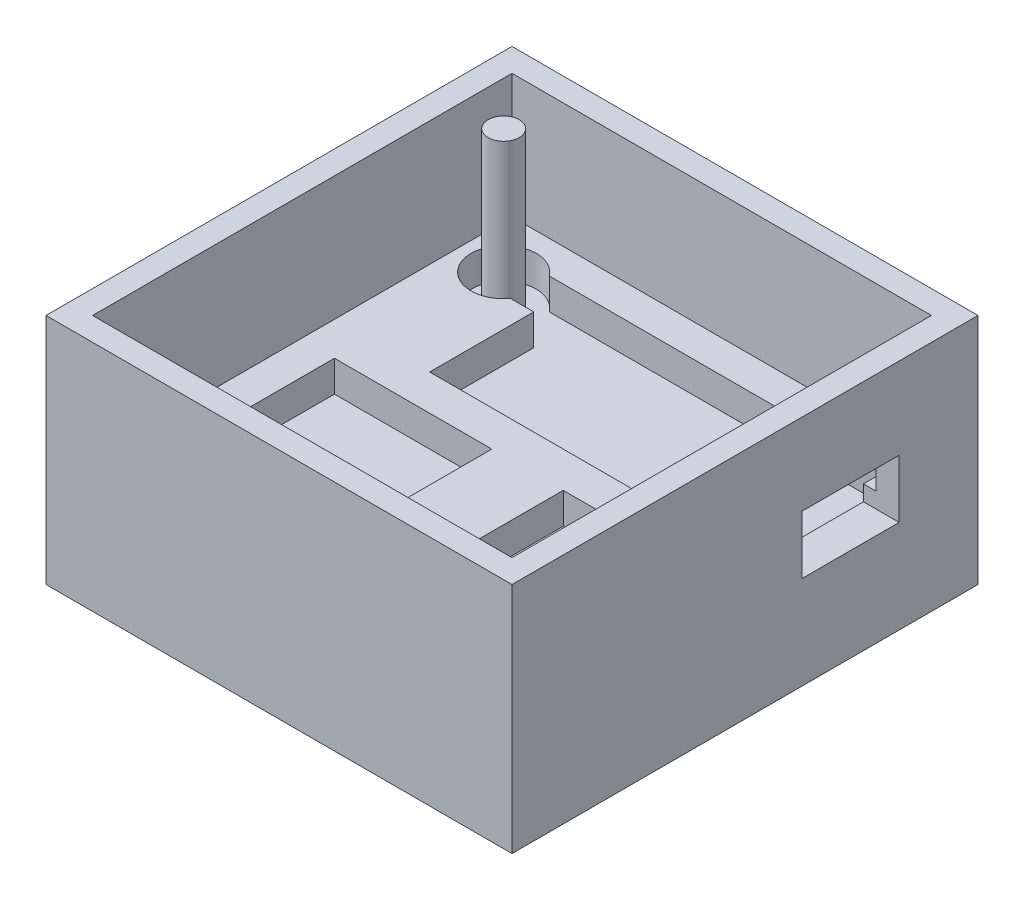
ISO-10303-21;
HEADER;
FILE_DESCRIPTION(('STEP AP214'),'2;1');
FILE_NAME('part.step','',(''),(''),'','','');
FILE_SCHEMA(('AUTOMOTIVE_DESIGN { 1 0 10303 214 1 1 1 1 }'));
ENDSEC;
DATA;
#1=APPLICATION_CONTEXT('core data for automotive mechanical design processes');
#2=APPLICATION_PROTOCOL_DEFINITION('international standard','automotive_design',2000,#1);
#3=PRODUCT_CONTEXT('',#1,'mechanical');
#4=PRODUCT('Part','Part','',(#3));
#5=PRODUCT_RELATED_PRODUCT_CATEGORY('part','',(#4));
#6=PRODUCT_DEFINITION_FORMATION('','',#4);
#7=PRODUCT_DEFINITION_CONTEXT('part definition',#1,'design');
#8=PRODUCT_DEFINITION('design','',#6,#7);
#9=PRODUCT_DEFINITION_SHAPE('','',#8);
#10=(LENGTH_UNIT() NAMED_UNIT(*) SI_UNIT(.MILLI.,.METRE.));
#11=(NAMED_UNIT(*) PLANE_ANGLE_UNIT() SI_UNIT($,.RADIAN.));
#12=(NAMED_UNIT(*) SI_UNIT($,.STERADIAN.) SOLID_ANGLE_UNIT());
#13=UNCERTAINTY_MEASURE_WITH_UNIT(LENGTH_MEASURE(1.E-05),#10,'distance_accuracy_value','');
#14=(GEOMETRIC_REPRESENTATION_CONTEXT(3) GLOBAL_UNCERTAINTY_ASSIGNED_CONTEXT((#13)) GLOBAL_UNIT_ASSIGNED_CONTEXT((#10,
#11,#12)) REPRESENTATION_CONTEXT('',''));
#15=CARTESIAN_POINT('',(0.,0.,0.));
#16=DIRECTION('',(0.,0.,1.));
#17=DIRECTION('',(1.,0.,0.));
#18=AXIS2_PLACEMENT_3D('',#15,#16,#17);
#19=CARTESIAN_POINT('',(38.1,38.1,38.1));
#20=DIRECTION('',(-1.,0.,0.));
#21=DIRECTION('',(0.,0.,1.));
#22=AXIS2_PLACEMENT_3D('',#19,#20,#21);
#23=PLANE('',#22);
#24=DIRECTION('',(0.,0.,-1.));
#25=VECTOR('',#24,1.);
#26=CARTESIAN_POINT('',(38.1,0.,38.1));
#27=LINE('',#26,#25);
#28=CARTESIAN_POINT('',(38.1,0.,38.1));
#29=VERTEX_POINT('',#28);
#30=CARTESIAN_POINT('',(38.1,0.,-38.1));
#31=VERTEX_POINT('',#30);
#32=EDGE_CURVE('E507',#29,#31,#27,.T.);
#33=ORIENTED_EDGE('',*,*,#32,.T.);
#34=DIRECTION('',(0.,-1.,0.));
#35=VECTOR('',#34,1.);
#36=CARTESIAN_POINT('',(38.1,38.1,-38.1));
#37=LINE('',#36,#35);
#38=CARTESIAN_POINT('',(38.1,38.1,-38.1));
#39=VERTEX_POINT('',#38);
#40=EDGE_CURVE('E521',#39,#31,#37,.T.);
#41=ORIENTED_EDGE('',*,*,#40,.F.);
#42=DIRECTION('',(0.,0.,-1.));
#43=VECTOR('',#42,1.);
#44=CARTESIAN_POINT('',(38.1,38.1,38.1));
#45=LINE('',#44,#43);
#46=CARTESIAN_POINT('',(38.1,38.1,38.1));
#47=VERTEX_POINT('',#46);
#48=EDGE_CURVE('E493',#47,#39,#45,.T.);
#49=ORIENTED_EDGE('',*,*,#48,.F.);
#50=DIRECTION('',(0.,-1.,0.));
#51=VECTOR('',#50,1.);
#52=CARTESIAN_POINT('',(38.1,38.1,38.1));
#53=LINE('',#52,#51);
#54=EDGE_CURVE('E517',#47,#29,#53,.T.);
#55=ORIENTED_EDGE('',*,*,#54,.T.);
#56=EDGE_LOOP('',(#33,#41,#49,#55));
#57=FACE_BOUND('',#56,.T.);
#58=DIRECTION('',(0.,1.,0.));
#59=VECTOR('',#58,1.);
#60=CARTESIAN_POINT('',(38.1,15.24,-9.3345));
#61=LINE('',#60,#59);
#62=CARTESIAN_POINT('',(38.1,15.24,-9.3345));
#63=VERTEX_POINT('',#62);
#64=CARTESIAN_POINT('',(38.1,24.765,-9.3345));
#65=VERTEX_POINT('',#64);
#66=EDGE_CURVE('E63',#63,#65,#61,.T.);
#67=ORIENTED_EDGE('',*,*,#66,.T.);
#68=DIRECTION('',(0.,0.,-1.));
#69=VECTOR('',#68,1.);
#70=CARTESIAN_POINT('',(38.1,24.765,-9.3345));
#71=LINE('',#70,#69);
#72=CARTESIAN_POINT('',(38.1,24.765,-25.2095));
#73=VERTEX_POINT('',#72);
#74=EDGE_CURVE('E272',#65,#73,#71,.T.);
#75=ORIENTED_EDGE('',*,*,#74,.T.);
#76=DIRECTION('',(0.,1.,0.));
#77=VECTOR('',#76,1.);
#78=CARTESIAN_POINT('',(38.1,15.24,-25.2095));
#79=LINE('',#78,#77);
#80=CARTESIAN_POINT('',(38.1,15.24,-25.2095));
#81=VERTEX_POINT('',#80);
#82=EDGE_CURVE('E276',#81,#73,#79,.T.);
#83=ORIENTED_EDGE('',*,*,#82,.F.);
#84=DIRECTION('',(0.,0.,-1.));
#85=VECTOR('',#84,1.);
#86=CARTESIAN_POINT('',(38.1,15.24,-9.3345));
#87=LINE('',#86,#85);
#88=EDGE_CURVE('E280',#63,#81,#87,.T.);
#89=ORIENTED_EDGE('',*,*,#88,.F.);
#90=EDGE_LOOP('',(#67,#75,#83,#89));
#91=FACE_BOUND('',#90,.T.);
#92=ADVANCED_FACE('F39',(#57,#91),#23,.F.);
#93=CARTESIAN_POINT('',(34.29,17.78,34.29));
#94=DIRECTION('',(1.,0.,0.));
#95=DIRECTION('',(0.,0.,-1.));
#96=AXIS2_PLACEMENT_3D('',#93,#94,#95);
#97=PLANE('',#96);
#98=DIRECTION('',(0.,1.,0.));
#99=VECTOR('',#98,1.);
#100=CARTESIAN_POINT('',(34.29,17.78,-9.3345));
#101=LINE('',#100,#99);
#102=CARTESIAN_POINT('',(34.29,17.78,-9.3345));
#103=VERTEX_POINT('',#102);
#104=CARTESIAN_POINT('',(34.29,24.765,-9.3345));
#105=VERTEX_POINT('',#104);
#106=EDGE_CURVE('E307',#103,#105,#101,.T.);
#107=ORIENTED_EDGE('',*,*,#106,.F.);
#108=DIRECTION('',(0.,0.,-1.));
#109=VECTOR('',#108,1.);
#110=CARTESIAN_POINT('',(34.29,17.78,34.29));
#111=LINE('',#110,#109);
#112=CARTESIAN_POINT('',(34.29,17.78,34.29));
#113=VERTEX_POINT('',#112);
#114=EDGE_CURVE('E363',#113,#103,#111,.T.);
#115=ORIENTED_EDGE('',*,*,#114,.F.);
#116=DIRECTION('',(0.,1.,0.));
#117=VECTOR('',#116,1.);
#118=CARTESIAN_POINT('',(34.29,17.78,34.29));
#119=LINE('',#118,#117);
#120=CARTESIAN_POINT('',(34.29,38.1,34.29));
#121=VERTEX_POINT('',#120);
#122=EDGE_CURVE('E375',#113,#121,#119,.T.);
#123=ORIENTED_EDGE('',*,*,#122,.T.);
#124=DIRECTION('',(0.,0.,-1.));
#125=VECTOR('',#124,1.);
#126=CARTESIAN_POINT('',(34.29,38.1,34.29));
#127=LINE('',#126,#125);
#128=CARTESIAN_POINT('',(34.29,38.1,-34.29));
#129=VERTEX_POINT('',#128);
#130=EDGE_CURVE('E378',#121,#129,#127,.T.);
#131=ORIENTED_EDGE('',*,*,#130,.T.);
#132=DIRECTION('',(0.,1.,0.));
#133=VECTOR('',#132,1.);
#134=CARTESIAN_POINT('',(34.29,17.78,-34.29));
#135=LINE('',#134,#133);
#136=CARTESIAN_POINT('',(34.29,17.78,-34.29));
#137=VERTEX_POINT('',#136);
#138=EDGE_CURVE('E396',#137,#129,#135,.T.);
#139=ORIENTED_EDGE('',*,*,#138,.F.);
#140=CARTESIAN_POINT('',(34.29,17.78,-25.2095));
#141=VERTEX_POINT('',#140);
#142=EDGE_CURVE('E361',#141,#137,#111,.T.);
#143=ORIENTED_EDGE('',*,*,#142,.F.);
#144=DIRECTION('',(0.,1.,0.));
#145=VECTOR('',#144,1.);
#146=CARTESIAN_POINT('',(34.29,17.78,-25.2095));
#147=LINE('',#146,#145);
#148=CARTESIAN_POINT('',(34.29,24.765,-25.2095));
#149=VERTEX_POINT('',#148);
#150=EDGE_CURVE('E299',#141,#149,#147,.T.);
#151=ORIENTED_EDGE('',*,*,#150,.T.);
#152=DIRECTION('',(0.,0.,-1.));
#153=VECTOR('',#152,1.);
#154=CARTESIAN_POINT('',(34.29,24.765,34.29));
#155=LINE('',#154,#153);
#156=EDGE_CURVE('E48',#105,#149,#155,.T.);
#157=ORIENTED_EDGE('',*,*,#156,.F.);
#158=EDGE_LOOP('',(#107,#115,#123,#131,#139,#143,#151,#157));
#159=FACE_BOUND('',#158,.T.);
#160=ADVANCED_FACE('F549',(#159),#97,.F.);
#161=CARTESIAN_POINT('',(0.,17.78,0.));
#162=DIRECTION('',(0.,1.,0.));
#163=DIRECTION('',(0.,0.,1.));
#164=AXIS2_PLACEMENT_3D('',#161,#162,#163);
#165=PLANE('',#164);
#166=DIRECTION('',(1.,0.,0.));
#167=VECTOR('',#166,1.);
#168=CARTESIAN_POINT('',(-19.05,17.78,-22.606));
#169=LINE('',#168,#167);
#170=CARTESIAN_POINT('',(-22.86,17.78,-22.606));
#171=VERTEX_POINT('',#170);
#172=CARTESIAN_POINT('',(-19.05,17.78,-22.606));
#173=VERTEX_POINT('',#172);
#174=EDGE_CURVE('E262',#171,#173,#169,.T.);
#175=ORIENTED_EDGE('',*,*,#174,.F.);
#176=CARTESIAN_POINT('',(-27.140733667368,17.78,-25.781));
#177=DIRECTION('',(0.,1.,0.));
#178=DIRECTION('',(0.,0.,1.));
#179=AXIS2_PLACEMENT_3D('',#176,#177,#178);
#180=CIRCLE('',#179,5.32966281587666);
#181=CARTESIAN_POINT('',(-22.86,17.78,-28.956));
#182=VERTEX_POINT('',#181);
#183=EDGE_CURVE('E258',#182,#171,#180,.T.);
#184=ORIENTED_EDGE('',*,*,#183,.F.);
#185=DIRECTION('',(-1.,0.,0.));
#186=VECTOR('',#185,1.);
#187=CARTESIAN_POINT('',(-19.05,17.78,-28.956));
#188=LINE('',#187,#186);
#189=CARTESIAN_POINT('',(32.258,17.78,-28.956));
#190=VERTEX_POINT('',#189);
#191=EDGE_CURVE('E243',#190,#182,#188,.T.);
#192=ORIENTED_EDGE('',*,*,#191,.F.);
#193=DIRECTION('',(0.,0.,-1.));
#194=VECTOR('',#193,1.);
#195=CARTESIAN_POINT('',(32.258,17.78,-28.956));
#196=LINE('',#195,#194);
#197=CARTESIAN_POINT('',(32.258,17.78,-25.2095));
#198=VERTEX_POINT('',#197);
#199=EDGE_CURVE('E317',#198,#190,#196,.T.);
#200=ORIENTED_EDGE('',*,*,#199,.F.);
#201=DIRECTION('',(-1.,0.,0.));
#202=VECTOR('',#201,1.);
#203=CARTESIAN_POINT('',(0.,17.78,-25.2095));
#204=LINE('',#203,#202);
#205=EDGE_CURVE('E296',#141,#198,#204,.T.);
#206=ORIENTED_EDGE('',*,*,#205,.F.);
#207=ORIENTED_EDGE('',*,*,#142,.T.);
#208=DIRECTION('',(-1.,0.,0.));
#209=VECTOR('',#208,1.);
#210=CARTESIAN_POINT('',(-34.29,17.78,-34.29));
#211=LINE('',#210,#209);
#212=CARTESIAN_POINT('',(-34.29,17.78,-34.29));
#213=VERTEX_POINT('',#212);
#214=EDGE_CURVE('E367',#137,#213,#211,.T.);
#215=ORIENTED_EDGE('',*,*,#214,.T.);
#216=DIRECTION('',(0.,0.,1.));
#217=VECTOR('',#216,1.);
#218=CARTESIAN_POINT('',(-34.29,17.78,34.29));
#219=LINE('',#218,#217);
#220=CARTESIAN_POINT('',(-34.29,17.78,34.29));
#221=VERTEX_POINT('',#220);
#222=EDGE_CURVE('E371',#213,#221,#219,.T.);
#223=ORIENTED_EDGE('',*,*,#222,.T.);
#224=DIRECTION('',(1.,0.,0.));
#225=VECTOR('',#224,1.);
#226=CARTESIAN_POINT('',(-34.29,17.78,34.29));
#227=LINE('',#226,#225);
#228=EDGE_CURVE('E357',#221,#113,#227,.T.);
#229=ORIENTED_EDGE('',*,*,#228,.T.);
#230=ORIENTED_EDGE('',*,*,#114,.T.);
#231=DIRECTION('',(-1.,0.,0.));
#232=VECTOR('',#231,1.);
#233=CARTESIAN_POINT('',(0.,17.78,-9.3345));
#234=LINE('',#233,#232);
#235=CARTESIAN_POINT('',(32.258,17.78,-9.3345));
#236=VERTEX_POINT('',#235);
#237=EDGE_CURVE('E303',#103,#236,#234,.T.);
#238=ORIENTED_EDGE('',*,*,#237,.T.);
#239=CARTESIAN_POINT('',(32.258,17.78,-5.58800000000001));
#240=VERTEX_POINT('',#239);
#241=EDGE_CURVE('E318',#240,#236,#196,.T.);
#242=ORIENTED_EDGE('',*,*,#241,.F.);
#243=DIRECTION('',(1.,0.,0.));
#244=VECTOR('',#243,1.);
#245=CARTESIAN_POINT('',(-19.05,17.78,-5.58800000000001));
#246=LINE('',#245,#244);
#247=CARTESIAN_POINT('',(-19.05,17.78,-5.58800000000001));
#248=VERTEX_POINT('',#247);
#249=EDGE_CURVE('E313',#248,#240,#246,.T.);
#250=ORIENTED_EDGE('',*,*,#249,.F.);
#251=DIRECTION('',(0.,0.,1.));
#252=VECTOR('',#251,1.);
#253=CARTESIAN_POINT('',(-19.05,17.78,-28.956));
#254=LINE('',#253,#252);
#255=EDGE_CURVE('E310',#173,#248,#254,.T.);
#256=ORIENTED_EDGE('',*,*,#255,.F.);
#257=EDGE_LOOP('',(#175,#184,#192,#200,#206,#207,#215,#223,#229,#230,#238,#242,#250,#256));
#258=FACE_BOUND('',#257,.T.);
#259=DIRECTION('',(-1.,0.,0.));
#260=VECTOR('',#259,1.);
#261=CARTESIAN_POINT('',(8.63600000000004,17.78,0.25399999999999));
#262=LINE('',#261,#260);
#263=CARTESIAN_POINT('',(32.258,17.78,0.25399999999999));
#264=VERTEX_POINT('',#263);
#265=CARTESIAN_POINT('',(8.63600000000004,17.78,0.25399999999999));
#266=VERTEX_POINT('',#265);
#267=EDGE_CURVE('E336',#264,#266,#262,.T.);
#268=ORIENTED_EDGE('',*,*,#267,.F.);
#269=DIRECTION('',(0.,0.,-1.));
#270=VECTOR('',#269,1.);
#271=CARTESIAN_POINT('',(32.258,17.78,0.25399999999999));
#272=LINE('',#271,#270);
#273=CARTESIAN_POINT('',(32.258,17.78,31.242));
#274=VERTEX_POINT('',#273);
#275=EDGE_CURVE('E332',#274,#264,#272,.T.);
#276=ORIENTED_EDGE('',*,*,#275,.F.);
#277=DIRECTION('',(1.,0.,0.));
#278=VECTOR('',#277,1.);
#279=CARTESIAN_POINT('',(8.63600000000004,17.78,31.242));
#280=LINE('',#279,#278);
#281=CARTESIAN_POINT('',(8.63600000000004,17.78,31.242));
#282=VERTEX_POINT('',#281);
#283=EDGE_CURVE('E328',#282,#274,#280,.T.);
#284=ORIENTED_EDGE('',*,*,#283,.F.);
#285=DIRECTION('',(0.,0.,1.));
#286=VECTOR('',#285,1.);
#287=CARTESIAN_POINT('',(8.63600000000004,17.78,0.25399999999999));
#288=LINE('',#287,#286);
#289=EDGE_CURVE('E324',#266,#282,#288,.T.);
#290=ORIENTED_EDGE('',*,*,#289,.F.);
#291=EDGE_LOOP('',(#268,#276,#284,#290));
#292=FACE_BOUND('',#291,.T.);
#293=DIRECTION('',(-1.,0.,0.));
#294=VECTOR('',#293,1.);
#295=CARTESIAN_POINT('',(-28.7782,17.78,0.25399999999999));
#296=LINE('',#295,#294);
#297=CARTESIAN_POINT('',(-3.04799999999996,17.78,0.25399999999999));
#298=VERTEX_POINT('',#297);
#299=CARTESIAN_POINT('',(-28.7782,17.78,0.25399999999999));
#300=VERTEX_POINT('',#299);
#301=EDGE_CURVE('E352',#298,#300,#296,.T.);
#302=ORIENTED_EDGE('',*,*,#301,.F.);
#303=DIRECTION('',(0.,0.,-1.));
#304=VECTOR('',#303,1.);
#305=CARTESIAN_POINT('',(-3.04799999999996,17.78,0.25399999999999));
#306=LINE('',#305,#304);
#307=CARTESIAN_POINT('',(-3.04799999999996,17.78,28.7782));
#308=VERTEX_POINT('',#307);
#309=EDGE_CURVE('E348',#308,#298,#306,.T.);
#310=ORIENTED_EDGE('',*,*,#309,.F.);
#311=DIRECTION('',(1.,0.,0.));
#312=VECTOR('',#311,1.);
#313=CARTESIAN_POINT('',(-28.7782,17.78,28.7782));
#314=LINE('',#313,#312);
#315=CARTESIAN_POINT('',(-28.7782,17.78,28.7782));
#316=VERTEX_POINT('',#315);
#317=EDGE_CURVE('E344',#316,#308,#314,.T.);
#318=ORIENTED_EDGE('',*,*,#317,.F.);
#319=DIRECTION('',(0.,0.,1.));
#320=VECTOR('',#319,1.);
#321=CARTESIAN_POINT('',(-28.7782,17.78,0.25399999999999));
#322=LINE('',#321,#320);
#323=EDGE_CURVE('E340',#300,#316,#322,.T.);
#324=ORIENTED_EDGE('',*,*,#323,.F.);
#325=EDGE_LOOP('',(#302,#310,#318,#324));
#326=FACE_BOUND('',#325,.T.);
#327=ADVANCED_FACE('F561',(#258,#292,#326),#165,.T.);
#328=CARTESIAN_POINT('',(32.258,12.7,-5.58800000000001));
#329=DIRECTION('',(1.,0.,0.));
#330=DIRECTION('',(0.,0.,-1.));
#331=AXIS2_PLACEMENT_3D('',#328,#329,#330);
#332=PLANE('',#331);
#333=DIRECTION('',(0.,1.,0.));
#334=VECTOR('',#333,1.);
#335=CARTESIAN_POINT('',(32.258,12.7,-9.3345));
#336=LINE('',#335,#334);
#337=CARTESIAN_POINT('',(32.258,15.24,-9.3345));
#338=VERTEX_POINT('',#337);
#339=EDGE_CURVE('E533',#338,#236,#336,.T.);
#340=ORIENTED_EDGE('',*,*,#339,.F.);
#341=DIRECTION('',(0.,0.,-1.));
#342=VECTOR('',#341,1.);
#343=CARTESIAN_POINT('',(32.258,15.24,-5.58800000000001));
#344=LINE('',#343,#342);
#345=CARTESIAN_POINT('',(32.258,15.24,-25.2095));
#346=VERTEX_POINT('',#345);
#347=EDGE_CURVE('E516',#338,#346,#344,.T.);
#348=ORIENTED_EDGE('',*,*,#347,.T.);
#349=DIRECTION('',(0.,1.,0.));
#350=VECTOR('',#349,1.);
#351=CARTESIAN_POINT('',(32.258,12.7,-25.2095));
#352=LINE('',#351,#350);
#353=EDGE_CURVE('E529',#346,#198,#352,.T.);
#354=ORIENTED_EDGE('',*,*,#353,.T.);
#355=ORIENTED_EDGE('',*,*,#199,.T.);
#356=DIRECTION('',(0.,1.,0.));
#357=VECTOR('',#356,1.);
#358=CARTESIAN_POINT('',(32.258,12.7,-28.956));
#359=LINE('',#358,#357);
#360=CARTESIAN_POINT('',(32.258,12.7,-28.956));
#361=VERTEX_POINT('',#360);
#362=EDGE_CURVE('E410',#361,#190,#359,.T.);
#363=ORIENTED_EDGE('',*,*,#362,.F.);
#364=DIRECTION('',(0.,0.,-1.));
#365=VECTOR('',#364,1.);
#366=CARTESIAN_POINT('',(32.258,12.7,-5.58800000000001));
#367=LINE('',#366,#365);
#368=CARTESIAN_POINT('',(32.258,12.7,-5.58800000000001));
#369=VERTEX_POINT('',#368);
#370=EDGE_CURVE('E233',#369,#361,#367,.T.);
#371=ORIENTED_EDGE('',*,*,#370,.F.);
#372=DIRECTION('',(0.,1.,0.));
#373=VECTOR('',#372,1.);
#374=CARTESIAN_POINT('',(32.258,12.7,-5.58800000000001));
#375=LINE('',#374,#373);
#376=EDGE_CURVE('E411',#369,#240,#375,.T.);
#377=ORIENTED_EDGE('',*,*,#376,.T.);
#378=ORIENTED_EDGE('',*,*,#241,.T.);
#379=EDGE_LOOP('',(#340,#348,#354,#355,#363,#371,#377,#378));
#380=FACE_BOUND('',#379,.T.);
#381=ADVANCED_FACE('F558',(#380),#332,.F.);
#382=CARTESIAN_POINT('',(-38.1,38.1,38.1));
#383=DIRECTION('',(-1.,0.,0.));
#384=DIRECTION('',(0.,0.,1.));
#385=AXIS2_PLACEMENT_3D('',#382,#383,#384);
#386=PLANE('',#385);
#387=DIRECTION('',(0.,0.,-1.));
#388=VECTOR('',#387,1.);
#389=CARTESIAN_POINT('',(-38.1,0.,38.1));
#390=LINE('',#389,#388);
#391=CARTESIAN_POINT('',(-38.1,0.,38.1));
#392=VERTEX_POINT('',#391);
#393=CARTESIAN_POINT('',(-38.1,0.,-38.1));
#394=VERTEX_POINT('',#393);
#395=EDGE_CURVE('E415',#392,#394,#390,.T.);
#396=ORIENTED_EDGE('',*,*,#395,.F.);
#397=DIRECTION('',(0.,-1.,0.));
#398=VECTOR('',#397,1.);
#399=CARTESIAN_POINT('',(-38.1,38.1,38.1));
#400=LINE('',#399,#398);
#401=CARTESIAN_POINT('',(-38.1,38.1,38.1));
#402=VERTEX_POINT('',#401);
#403=EDGE_CURVE('E513',#402,#392,#400,.T.);
#404=ORIENTED_EDGE('',*,*,#403,.F.);
#405=DIRECTION('',(0.,0.,-1.));
#406=VECTOR('',#405,1.);
#407=CARTESIAN_POINT('',(-38.1,38.1,38.1));
#408=LINE('',#407,#406);
#409=CARTESIAN_POINT('',(-38.1,38.1,-38.1));
#410=VERTEX_POINT('',#409);
#411=EDGE_CURVE('E484',#402,#410,#408,.T.);
#412=ORIENTED_EDGE('',*,*,#411,.T.);
#413=DIRECTION('',(0.,-1.,0.));
#414=VECTOR('',#413,1.);
#415=CARTESIAN_POINT('',(-38.1,38.1,-38.1));
#416=LINE('',#415,#414);
#417=EDGE_CURVE('E499',#410,#394,#416,.T.);
#418=ORIENTED_EDGE('',*,*,#417,.T.);
#419=EDGE_LOOP('',(#396,#404,#412,#418));
#420=FACE_BOUND('',#419,.T.);
#421=ADVANCED_FACE('F41',(#420),#386,.T.);
#422=CARTESIAN_POINT('',(-38.1,38.1,38.1));
#423=DIRECTION('',(0.,0.,-1.));
#424=DIRECTION('',(-1.,0.,0.));
#425=AXIS2_PLACEMENT_3D('',#422,#423,#424);
#426=PLANE('',#425);
#427=DIRECTION('',(1.,0.,0.));
#428=VECTOR('',#427,1.);
#429=CARTESIAN_POINT('',(-38.1,0.,38.1));
#430=LINE('',#429,#428);
#431=EDGE_CURVE('E489',#392,#29,#430,.T.);
#432=ORIENTED_EDGE('',*,*,#431,.T.);
#433=ORIENTED_EDGE('',*,*,#54,.F.);
#434=DIRECTION('',(1.,0.,0.));
#435=VECTOR('',#434,1.);
#436=CARTESIAN_POINT('',(-38.1,38.1,38.1));
#437=LINE('',#436,#435);
#438=EDGE_CURVE('E496',#402,#47,#437,.T.);
#439=ORIENTED_EDGE('',*,*,#438,.F.);
#440=ORIENTED_EDGE('',*,*,#403,.T.);
#441=EDGE_LOOP('',(#432,#433,#439,#440));
#442=FACE_BOUND('',#441,.T.);
#443=ADVANCED_FACE('F611',(#442),#426,.F.);
#444=CARTESIAN_POINT('',(-38.1,38.1,-38.1));
#445=DIRECTION('',(0.,0.,-1.));
#446=DIRECTION('',(-1.,0.,0.));
#447=AXIS2_PLACEMENT_3D('',#444,#445,#446);
#448=PLANE('',#447);
#449=DIRECTION('',(1.,0.,0.));
#450=VECTOR('',#449,1.);
#451=CARTESIAN_POINT('',(-38.1,0.,-38.1));
#452=LINE('',#451,#450);
#453=EDGE_CURVE('E503',#394,#31,#452,.T.);
#454=ORIENTED_EDGE('',*,*,#453,.F.);
#455=ORIENTED_EDGE('',*,*,#417,.F.);
#456=DIRECTION('',(1.,0.,0.));
#457=VECTOR('',#456,1.);
#458=CARTESIAN_POINT('',(-38.1,38.1,-38.1));
#459=LINE('',#458,#457);
#460=EDGE_CURVE('E488',#410,#39,#459,.T.);
#461=ORIENTED_EDGE('',*,*,#460,.T.);
#462=ORIENTED_EDGE('',*,*,#40,.T.);
#463=EDGE_LOOP('',(#454,#455,#461,#462));
#464=FACE_BOUND('',#463,.T.);
#465=ADVANCED_FACE('F613',(#464),#448,.T.);
#466=CARTESIAN_POINT('',(0.,38.1,0.));
#467=DIRECTION('',(0.,-1.,0.));
#468=DIRECTION('',(0.,0.,-1.));
#469=AXIS2_PLACEMENT_3D('',#466,#467,#468);
#470=PLANE('',#469);
#471=ORIENTED_EDGE('',*,*,#130,.F.);
#472=DIRECTION('',(1.,0.,0.));
#473=VECTOR('',#472,1.);
#474=CARTESIAN_POINT('',(-34.29,38.1,34.29));
#475=LINE('',#474,#473);
#476=CARTESIAN_POINT('',(-34.29,38.1,34.29));
#477=VERTEX_POINT('',#476);
#478=EDGE_CURVE('E356',#477,#121,#475,.T.);
#479=ORIENTED_EDGE('',*,*,#478,.F.);
#480=DIRECTION('',(0.,0.,1.));
#481=VECTOR('',#480,1.);
#482=CARTESIAN_POINT('',(-34.29,38.1,34.29));
#483=LINE('',#482,#481);
#484=CARTESIAN_POINT('',(-34.29,38.1,-34.29));
#485=VERTEX_POINT('',#484);
#486=EDGE_CURVE('E362',#485,#477,#483,.T.);
#487=ORIENTED_EDGE('',*,*,#486,.F.);
#488=DIRECTION('',(-1.,0.,0.));
#489=VECTOR('',#488,1.);
#490=CARTESIAN_POINT('',(-34.29,38.1,-34.29));
#491=LINE('',#490,#489);
#492=EDGE_CURVE('E382',#129,#485,#491,.T.);
#493=ORIENTED_EDGE('',*,*,#492,.F.);
#494=EDGE_LOOP('',(#471,#479,#487,#493));
#495=FACE_BOUND('',#494,.T.);
#496=ORIENTED_EDGE('',*,*,#411,.F.);
#497=ORIENTED_EDGE('',*,*,#438,.T.);
#498=ORIENTED_EDGE('',*,*,#48,.T.);
#499=ORIENTED_EDGE('',*,*,#460,.F.);
#500=EDGE_LOOP('',(#496,#497,#498,#499));
#501=FACE_BOUND('',#500,.T.);
#502=ADVANCED_FACE('F584',(#495,#501),#470,.F.);
#503=CARTESIAN_POINT('',(0.,0.,0.));
#504=DIRECTION('',(0.,-1.,0.));
#505=DIRECTION('',(0.,0.,-1.));
#506=AXIS2_PLACEMENT_3D('',#503,#504,#505);
#507=PLANE('',#506);
#508=ORIENTED_EDGE('',*,*,#395,.T.);
#509=ORIENTED_EDGE('',*,*,#453,.T.);
#510=ORIENTED_EDGE('',*,*,#32,.F.);
#511=ORIENTED_EDGE('',*,*,#431,.F.);
#512=EDGE_LOOP('',(#508,#509,#510,#511));
#513=FACE_BOUND('',#512,.T.);
#514=ADVANCED_FACE('F599',(#513),#507,.T.);
#515=CARTESIAN_POINT('',(-34.29,17.78,34.29));
#516=DIRECTION('',(0.,0.,1.));
#517=DIRECTION('',(1.,0.,0.));
#518=AXIS2_PLACEMENT_3D('',#515,#516,#517);
#519=PLANE('',#518);
#520=ORIENTED_EDGE('',*,*,#478,.T.);
#521=ORIENTED_EDGE('',*,*,#122,.F.);
#522=ORIENTED_EDGE('',*,*,#228,.F.);
#523=DIRECTION('',(0.,1.,0.));
#524=VECTOR('',#523,1.);
#525=CARTESIAN_POINT('',(-34.29,17.78,34.29));
#526=LINE('',#525,#524);
#527=EDGE_CURVE('E389',#221,#477,#526,.T.);
#528=ORIENTED_EDGE('',*,*,#527,.T.);
#529=EDGE_LOOP('',(#520,#521,#522,#528));
#530=FACE_BOUND('',#529,.T.);
#531=ADVANCED_FACE('F580',(#530),#519,.F.);
#532=CARTESIAN_POINT('',(-34.29,17.78,34.29));
#533=DIRECTION('',(-1.,0.,0.));
#534=DIRECTION('',(0.,0.,1.));
#535=AXIS2_PLACEMENT_3D('',#532,#533,#534);
#536=PLANE('',#535);
#537=ORIENTED_EDGE('',*,*,#486,.T.);
#538=ORIENTED_EDGE('',*,*,#527,.F.);
#539=ORIENTED_EDGE('',*,*,#222,.F.);
#540=DIRECTION('',(0.,1.,0.));
#541=VECTOR('',#540,1.);
#542=CARTESIAN_POINT('',(-34.29,17.78,-34.29));
#543=LINE('',#542,#541);
#544=EDGE_CURVE('E393',#213,#485,#543,.T.);
#545=ORIENTED_EDGE('',*,*,#544,.T.);
#546=EDGE_LOOP('',(#537,#538,#539,#545));
#547=FACE_BOUND('',#546,.T.);
#548=ADVANCED_FACE('F590',(#547),#536,.F.);
#549=CARTESIAN_POINT('',(-34.29,17.78,-34.29));
#550=DIRECTION('',(0.,0.,-1.));
#551=DIRECTION('',(-1.,0.,0.));
#552=AXIS2_PLACEMENT_3D('',#549,#550,#551);
#553=PLANE('',#552);
#554=ORIENTED_EDGE('',*,*,#492,.T.);
#555=ORIENTED_EDGE('',*,*,#544,.F.);
#556=ORIENTED_EDGE('',*,*,#214,.F.);
#557=ORIENTED_EDGE('',*,*,#138,.T.);
#558=EDGE_LOOP('',(#554,#555,#556,#557));
#559=FACE_BOUND('',#558,.T.);
#560=ADVANCED_FACE('F588',(#559),#553,.F.);
#561=CARTESIAN_POINT('',(0.,12.7,0.));
#562=DIRECTION('',(0.,1.,0.));
#563=DIRECTION('',(0.,0.,1.));
#564=AXIS2_PLACEMENT_3D('',#561,#562,#563);
#565=PLANE('',#564);
#566=DIRECTION('',(0.,0.,-1.));
#567=VECTOR('',#566,1.);
#568=CARTESIAN_POINT('',(32.258,12.7,0.25399999999999));
#569=LINE('',#568,#567);
#570=CARTESIAN_POINT('',(32.258,12.7,31.242));
#571=VERTEX_POINT('',#570);
#572=CARTESIAN_POINT('',(32.258,12.7,0.25399999999999));
#573=VERTEX_POINT('',#572);
#574=EDGE_CURVE('E422',#571,#573,#569,.T.);
#575=ORIENTED_EDGE('',*,*,#574,.T.);
#576=DIRECTION('',(-1.,0.,0.));
#577=VECTOR('',#576,1.);
#578=CARTESIAN_POINT('',(8.63600000000004,12.7,0.25399999999999));
#579=LINE('',#578,#577);
#580=CARTESIAN_POINT('',(8.63600000000004,12.7,0.25399999999999));
#581=VERTEX_POINT('',#580);
#582=EDGE_CURVE('E426',#573,#581,#579,.T.);
#583=ORIENTED_EDGE('',*,*,#582,.T.);
#584=DIRECTION('',(0.,0.,1.));
#585=VECTOR('',#584,1.);
#586=CARTESIAN_POINT('',(8.63600000000004,12.7,0.25399999999999));
#587=LINE('',#586,#585);
#588=CARTESIAN_POINT('',(8.63600000000004,12.7,31.242));
#589=VERTEX_POINT('',#588);
#590=EDGE_CURVE('E431',#581,#589,#587,.T.);
#591=ORIENTED_EDGE('',*,*,#590,.T.);
#592=DIRECTION('',(1.,0.,0.));
#593=VECTOR('',#592,1.);
#594=CARTESIAN_POINT('',(8.63600000000004,12.7,31.242));
#595=LINE('',#594,#593);
#596=EDGE_CURVE('E435',#589,#571,#595,.T.);
#597=ORIENTED_EDGE('',*,*,#596,.T.);
#598=EDGE_LOOP('',(#575,#583,#591,#597));
#599=FACE_BOUND('',#598,.T.);
#600=ADVANCED_FACE('F597',(#599),#565,.T.);
#601=CARTESIAN_POINT('',(8.63600000000004,12.7,0.25399999999999));
#602=DIRECTION('',(0.,0.,-1.));
#603=DIRECTION('',(-1.,0.,0.));
#604=AXIS2_PLACEMENT_3D('',#601,#602,#603);
#605=PLANE('',#604);
#606=ORIENTED_EDGE('',*,*,#267,.T.);
#607=DIRECTION('',(0.,1.,0.));
#608=VECTOR('',#607,1.);
#609=CARTESIAN_POINT('',(8.63600000000004,12.7,0.25399999999999));
#610=LINE('',#609,#608);
#611=EDGE_CURVE('E447',#581,#266,#610,.T.);
#612=ORIENTED_EDGE('',*,*,#611,.F.);
#613=ORIENTED_EDGE('',*,*,#582,.F.);
#614=DIRECTION('',(0.,1.,0.));
#615=VECTOR('',#614,1.);
#616=CARTESIAN_POINT('',(32.258,12.7,0.25399999999999));
#617=LINE('',#616,#615);
#618=EDGE_CURVE('E439',#573,#264,#617,.T.);
#619=ORIENTED_EDGE('',*,*,#618,.T.);
#620=EDGE_LOOP('',(#606,#612,#613,#619));
#621=FACE_BOUND('',#620,.T.);
#622=ADVANCED_FACE('F647',(#621),#605,.F.);
#623=CARTESIAN_POINT('',(8.63600000000004,12.7,0.25399999999999));
#624=DIRECTION('',(-1.,0.,0.));
#625=DIRECTION('',(0.,0.,1.));
#626=AXIS2_PLACEMENT_3D('',#623,#624,#625);
#627=PLANE('',#626);
#628=ORIENTED_EDGE('',*,*,#289,.T.);
#629=DIRECTION('',(0.,1.,0.));
#630=VECTOR('',#629,1.);
#631=CARTESIAN_POINT('',(8.63600000000004,12.7,31.242));
#632=LINE('',#631,#630);
#633=EDGE_CURVE('E443',#589,#282,#632,.T.);
#634=ORIENTED_EDGE('',*,*,#633,.F.);
#635=ORIENTED_EDGE('',*,*,#590,.F.);
#636=ORIENTED_EDGE('',*,*,#611,.T.);
#637=EDGE_LOOP('',(#628,#634,#635,#636));
#638=FACE_BOUND('',#637,.T.);
#639=ADVANCED_FACE('F653',(#638),#627,.F.);
#640=CARTESIAN_POINT('',(8.63600000000004,12.7,31.242));
#641=DIRECTION('',(0.,0.,1.));
#642=DIRECTION('',(1.,0.,0.));
#643=AXIS2_PLACEMENT_3D('',#640,#641,#642);
#644=PLANE('',#643);
#645=ORIENTED_EDGE('',*,*,#283,.T.);
#646=DIRECTION('',(0.,1.,0.));
#647=VECTOR('',#646,1.);
#648=CARTESIAN_POINT('',(32.258,12.7,31.242));
#649=LINE('',#648,#647);
#650=EDGE_CURVE('E403',#571,#274,#649,.T.);
#651=ORIENTED_EDGE('',*,*,#650,.F.);
#652=ORIENTED_EDGE('',*,*,#596,.F.);
#653=ORIENTED_EDGE('',*,*,#633,.T.);
#654=EDGE_LOOP('',(#645,#651,#652,#653));
#655=FACE_BOUND('',#654,.T.);
#656=ADVANCED_FACE('F649',(#655),#644,.F.);
#657=CARTESIAN_POINT('',(32.258,12.7,0.25399999999999));
#658=DIRECTION('',(1.,0.,0.));
#659=DIRECTION('',(0.,0.,-1.));
#660=AXIS2_PLACEMENT_3D('',#657,#658,#659);
#661=PLANE('',#660);
#662=ORIENTED_EDGE('',*,*,#275,.T.);
#663=ORIENTED_EDGE('',*,*,#618,.F.);
#664=ORIENTED_EDGE('',*,*,#574,.F.);
#665=ORIENTED_EDGE('',*,*,#650,.T.);
#666=EDGE_LOOP('',(#662,#663,#664,#665));
#667=FACE_BOUND('',#666,.T.);
#668=ADVANCED_FACE('F652',(#667),#661,.F.);
#669=CARTESIAN_POINT('',(0.,12.7,0.));
#670=DIRECTION('',(0.,-1.,0.));
#671=DIRECTION('',(0.,0.,-1.));
#672=AXIS2_PLACEMENT_3D('',#669,#670,#671);
#673=PLANE('',#672);
#674=DIRECTION('',(0.,0.,-1.));
#675=VECTOR('',#674,1.);
#676=CARTESIAN_POINT('',(-3.04799999999996,12.7,28.7782));
#677=LINE('',#676,#675);
#678=CARTESIAN_POINT('',(-3.04799999999996,12.7,28.7782));
#679=VERTEX_POINT('',#678);
#680=CARTESIAN_POINT('',(-3.04799999999996,12.7,0.25399999999999));
#681=VERTEX_POINT('',#680);
#682=EDGE_CURVE('E392',#679,#681,#677,.T.);
#683=ORIENTED_EDGE('',*,*,#682,.T.);
#684=DIRECTION('',(-1.,0.,0.));
#685=VECTOR('',#684,1.);
#686=CARTESIAN_POINT('',(-28.7782,12.7,0.25399999999999));
#687=LINE('',#686,#685);
#688=CARTESIAN_POINT('',(-28.7782,12.7,0.25399999999999));
#689=VERTEX_POINT('',#688);
#690=EDGE_CURVE('E457',#681,#689,#687,.T.);
#691=ORIENTED_EDGE('',*,*,#690,.T.);
#692=DIRECTION('',(0.,0.,1.));
#693=VECTOR('',#692,1.);
#694=CARTESIAN_POINT('',(-28.7782,12.7,28.7782));
#695=LINE('',#694,#693);
#696=CARTESIAN_POINT('',(-28.7782,12.7,28.7782));
#697=VERTEX_POINT('',#696);
#698=EDGE_CURVE('E461',#689,#697,#695,.T.);
#699=ORIENTED_EDGE('',*,*,#698,.T.);
#700=DIRECTION('',(1.,0.,0.));
#701=VECTOR('',#700,1.);
#702=CARTESIAN_POINT('',(-28.7782,12.7,28.7782));
#703=LINE('',#702,#701);
#704=EDGE_CURVE('E465',#697,#679,#703,.T.);
#705=ORIENTED_EDGE('',*,*,#704,.T.);
#706=EDGE_LOOP('',(#683,#691,#699,#705));
#707=FACE_BOUND('',#706,.T.);
#708=ADVANCED_FACE('F663',(#707),#673,.F.);
#709=CARTESIAN_POINT('',(-28.7782,12.7,0.25399999999999));
#710=DIRECTION('',(0.,0.,-1.));
#711=DIRECTION('',(-1.,0.,0.));
#712=AXIS2_PLACEMENT_3D('',#709,#710,#711);
#713=PLANE('',#712);
#714=ORIENTED_EDGE('',*,*,#301,.T.);
#715=DIRECTION('',(0.,1.,0.));
#716=VECTOR('',#715,1.);
#717=CARTESIAN_POINT('',(-28.7782,12.7,0.25399999999999));
#718=LINE('',#717,#716);
#719=EDGE_CURVE('E477',#689,#300,#718,.T.);
#720=ORIENTED_EDGE('',*,*,#719,.F.);
#721=ORIENTED_EDGE('',*,*,#690,.F.);
#722=DIRECTION('',(0.,1.,0.));
#723=VECTOR('',#722,1.);
#724=CARTESIAN_POINT('',(-3.04799999999996,12.7,0.25399999999999));
#725=LINE('',#724,#723);
#726=EDGE_CURVE('E469',#681,#298,#725,.T.);
#727=ORIENTED_EDGE('',*,*,#726,.T.);
#728=EDGE_LOOP('',(#714,#720,#721,#727));
#729=FACE_BOUND('',#728,.T.);
#730=ADVANCED_FACE('F667',(#729),#713,.F.);
#731=CARTESIAN_POINT('',(-28.7782,12.7,28.7782));
#732=DIRECTION('',(-1.,0.,0.));
#733=DIRECTION('',(0.,0.,1.));
#734=AXIS2_PLACEMENT_3D('',#731,#732,#733);
#735=PLANE('',#734);
#736=ORIENTED_EDGE('',*,*,#323,.T.);
#737=DIRECTION('',(0.,1.,0.));
#738=VECTOR('',#737,1.);
#739=CARTESIAN_POINT('',(-28.7782,12.7,28.7782));
#740=LINE('',#739,#738);
#741=EDGE_CURVE('E473',#697,#316,#740,.T.);
#742=ORIENTED_EDGE('',*,*,#741,.F.);
#743=ORIENTED_EDGE('',*,*,#698,.F.);
#744=ORIENTED_EDGE('',*,*,#719,.T.);
#745=EDGE_LOOP('',(#736,#742,#743,#744));
#746=FACE_BOUND('',#745,.T.);
#747=ADVANCED_FACE('F673',(#746),#735,.F.);
#748=CARTESIAN_POINT('',(-28.7782,12.7,28.7782));
#749=DIRECTION('',(0.,0.,1.));
#750=DIRECTION('',(1.,0.,0.));
#751=AXIS2_PLACEMENT_3D('',#748,#749,#750);
#752=PLANE('',#751);
#753=ORIENTED_EDGE('',*,*,#317,.T.);
#754=DIRECTION('',(0.,1.,0.));
#755=VECTOR('',#754,1.);
#756=CARTESIAN_POINT('',(-3.04799999999996,12.7,28.7782));
#757=LINE('',#756,#755);
#758=EDGE_CURVE('E427',#679,#308,#757,.T.);
#759=ORIENTED_EDGE('',*,*,#758,.F.);
#760=ORIENTED_EDGE('',*,*,#704,.F.);
#761=ORIENTED_EDGE('',*,*,#741,.T.);
#762=EDGE_LOOP('',(#753,#759,#760,#761));
#763=FACE_BOUND('',#762,.T.);
#764=ADVANCED_FACE('F669',(#763),#752,.F.);
#765=CARTESIAN_POINT('',(-3.04799999999996,12.7,28.7782));
#766=DIRECTION('',(1.,0.,0.));
#767=DIRECTION('',(0.,0.,-1.));
#768=AXIS2_PLACEMENT_3D('',#765,#766,#767);
#769=PLANE('',#768);
#770=ORIENTED_EDGE('',*,*,#309,.T.);
#771=ORIENTED_EDGE('',*,*,#726,.F.);
#772=ORIENTED_EDGE('',*,*,#682,.F.);
#773=ORIENTED_EDGE('',*,*,#758,.T.);
#774=EDGE_LOOP('',(#770,#771,#772,#773));
#775=FACE_BOUND('',#774,.T.);
#776=ADVANCED_FACE('F672',(#775),#769,.F.);
#777=CARTESIAN_POINT('',(0.,12.7,0.));
#778=DIRECTION('',(0.,-1.,0.));
#779=DIRECTION('',(0.,0.,-1.));
#780=AXIS2_PLACEMENT_3D('',#777,#778,#779);
#781=PLANE('',#780);
#782=CARTESIAN_POINT('',(-27.140733667368,12.7,-25.781));
#783=DIRECTION('',(0.,-1.,0.));
#784=DIRECTION('',(0.,0.,-1.));
#785=AXIS2_PLACEMENT_3D('',#782,#783,#784);
#786=CIRCLE('',#785,2.54);
#787=CARTESIAN_POINT('',(-27.140733667368,12.7,-28.321));
#788=VERTEX_POINT('',#787);
#789=EDGE_CURVE('E11',#788,#788,#786,.F.);
#790=ORIENTED_EDGE('',*,*,#789,.F.);
#791=EDGE_LOOP('',(#790));
#792=FACE_BOUND('',#791,.T.);
#793=ORIENTED_EDGE('',*,*,#370,.T.);
#794=DIRECTION('',(-1.,0.,0.));
#795=VECTOR('',#794,1.);
#796=CARTESIAN_POINT('',(-19.05,12.7,-28.956));
#797=LINE('',#796,#795);
#798=CARTESIAN_POINT('',(-22.86,12.7,-28.956));
#799=VERTEX_POINT('',#798);
#800=EDGE_CURVE('E226',#361,#799,#797,.T.);
#801=ORIENTED_EDGE('',*,*,#800,.T.);
#802=CARTESIAN_POINT('',(-27.140733667368,12.7,-25.781));
#803=DIRECTION('',(0.,1.,0.));
#804=DIRECTION('',(0.,0.,1.));
#805=AXIS2_PLACEMENT_3D('',#802,#803,#804);
#806=CIRCLE('',#805,5.32966281587666);
#807=CARTESIAN_POINT('',(-22.86,12.7,-22.606));
#808=VERTEX_POINT('',#807);
#809=EDGE_CURVE('E230',#799,#808,#806,.T.);
#810=ORIENTED_EDGE('',*,*,#809,.T.);
#811=DIRECTION('',(1.,0.,0.));
#812=VECTOR('',#811,1.);
#813=CARTESIAN_POINT('',(-19.05,12.7,-22.606));
#814=LINE('',#813,#812);
#815=CARTESIAN_POINT('',(-19.05,12.7,-22.606));
#816=VERTEX_POINT('',#815);
#817=EDGE_CURVE('E55',#808,#816,#814,.T.);
#818=ORIENTED_EDGE('',*,*,#817,.T.);
#819=DIRECTION('',(0.,0.,1.));
#820=VECTOR('',#819,1.);
#821=CARTESIAN_POINT('',(-19.05,12.7,-5.58800000000001));
#822=LINE('',#821,#820);
#823=CARTESIAN_POINT('',(-19.05,12.7,-5.58800000000001));
#824=VERTEX_POINT('',#823);
#825=EDGE_CURVE('E237',#816,#824,#822,.T.);
#826=ORIENTED_EDGE('',*,*,#825,.T.);
#827=DIRECTION('',(1.,0.,0.));
#828=VECTOR('',#827,1.);
#829=CARTESIAN_POINT('',(-19.05,12.7,-5.58800000000001));
#830=LINE('',#829,#828);
#831=EDGE_CURVE('E407',#824,#369,#830,.T.);
#832=ORIENTED_EDGE('',*,*,#831,.T.);
#833=EDGE_LOOP('',(#793,#801,#810,#818,#826,#832));
#834=FACE_BOUND('',#833,.T.);
#835=ADVANCED_FACE('F228',(#792,#834),#781,.F.);
#836=CARTESIAN_POINT('',(-19.05,12.7,-28.956));
#837=DIRECTION('',(0.,0.,-1.));
#838=DIRECTION('',(-1.,0.,0.));
#839=AXIS2_PLACEMENT_3D('',#836,#837,#838);
#840=PLANE('',#839);
#841=ORIENTED_EDGE('',*,*,#191,.T.);
#842=DIRECTION('',(0.,1.,0.));
#843=VECTOR('',#842,1.);
#844=CARTESIAN_POINT('',(-22.86,12.7,-28.956));
#845=LINE('',#844,#843);
#846=EDGE_CURVE('E240',#799,#182,#845,.T.);
#847=ORIENTED_EDGE('',*,*,#846,.F.);
#848=ORIENTED_EDGE('',*,*,#800,.F.);
#849=ORIENTED_EDGE('',*,*,#362,.T.);
#850=EDGE_LOOP('',(#841,#847,#848,#849));
#851=FACE_BOUND('',#850,.T.);
#852=ADVANCED_FACE('F241',(#851),#840,.F.);
#853=CARTESIAN_POINT('',(-19.05,12.7,-5.58800000000001));
#854=DIRECTION('',(-1.,0.,0.));
#855=DIRECTION('',(0.,0.,1.));
#856=AXIS2_PLACEMENT_3D('',#853,#854,#855);
#857=PLANE('',#856);
#858=ORIENTED_EDGE('',*,*,#825,.F.);
#859=DIRECTION('',(0.,1.,0.));
#860=VECTOR('',#859,1.);
#861=CARTESIAN_POINT('',(-19.05,12.7,-22.606));
#862=LINE('',#861,#860);
#863=EDGE_CURVE('E249',#816,#173,#862,.T.);
#864=ORIENTED_EDGE('',*,*,#863,.T.);
#865=ORIENTED_EDGE('',*,*,#255,.T.);
#866=DIRECTION('',(0.,1.,0.));
#867=VECTOR('',#866,1.);
#868=CARTESIAN_POINT('',(-19.05,12.7,-5.58800000000001));
#869=LINE('',#868,#867);
#870=EDGE_CURVE('E416',#824,#248,#869,.T.);
#871=ORIENTED_EDGE('',*,*,#870,.F.);
#872=EDGE_LOOP('',(#858,#864,#865,#871));
#873=FACE_BOUND('',#872,.T.);
#874=ADVANCED_FACE('F569',(#873),#857,.F.);
#875=CARTESIAN_POINT('',(-19.05,12.7,-5.58800000000001));
#876=DIRECTION('',(0.,0.,1.));
#877=DIRECTION('',(1.,0.,0.));
#878=AXIS2_PLACEMENT_3D('',#875,#876,#877);
#879=PLANE('',#878);
#880=ORIENTED_EDGE('',*,*,#249,.T.);
#881=ORIENTED_EDGE('',*,*,#376,.F.);
#882=ORIENTED_EDGE('',*,*,#831,.F.);
#883=ORIENTED_EDGE('',*,*,#870,.T.);
#884=EDGE_LOOP('',(#880,#881,#882,#883));
#885=FACE_BOUND('',#884,.T.);
#886=ADVANCED_FACE('F573',(#885),#879,.F.);
#887=CARTESIAN_POINT('',(17.78,24.765,-9.3345));
#888=DIRECTION('',(0.,-1.,0.));
#889=DIRECTION('',(0.,0.,-1.));
#890=AXIS2_PLACEMENT_3D('',#887,#888,#889);
#891=PLANE('',#890);
#892=ORIENTED_EDGE('',*,*,#156,.T.);
#893=DIRECTION('',(1.,0.,0.));
#894=VECTOR('',#893,1.);
#895=CARTESIAN_POINT('',(17.78,24.765,-25.2095));
#896=LINE('',#895,#894);
#897=EDGE_CURVE('E290',#149,#73,#896,.T.);
#898=ORIENTED_EDGE('',*,*,#897,.T.);
#899=ORIENTED_EDGE('',*,*,#74,.F.);
#900=DIRECTION('',(1.,0.,0.));
#901=VECTOR('',#900,1.);
#902=CARTESIAN_POINT('',(17.78,24.765,-9.3345));
#903=LINE('',#902,#901);
#904=EDGE_CURVE('E293',#105,#65,#903,.T.);
#905=ORIENTED_EDGE('',*,*,#904,.F.);
#906=EDGE_LOOP('',(#892,#898,#899,#905));
#907=FACE_BOUND('',#906,.T.);
#908=ADVANCED_FACE('F540',(#907),#891,.T.);
#909=CARTESIAN_POINT('',(17.78,15.24,-9.3345));
#910=DIRECTION('',(0.,0.,-1.));
#911=DIRECTION('',(-1.,0.,0.));
#912=AXIS2_PLACEMENT_3D('',#909,#910,#911);
#913=PLANE('',#912);
#914=ORIENTED_EDGE('',*,*,#106,.T.);
#915=ORIENTED_EDGE('',*,*,#904,.T.);
#916=ORIENTED_EDGE('',*,*,#66,.F.);
#917=DIRECTION('',(1.,0.,0.));
#918=VECTOR('',#917,1.);
#919=CARTESIAN_POINT('',(17.78,15.24,-9.3345));
#920=LINE('',#919,#918);
#921=EDGE_CURVE('E284',#338,#63,#920,.T.);
#922=ORIENTED_EDGE('',*,*,#921,.F.);
#923=ORIENTED_EDGE('',*,*,#339,.T.);
#924=ORIENTED_EDGE('',*,*,#237,.F.);
#925=EDGE_LOOP('',(#914,#915,#916,#922,#923,#924));
#926=FACE_BOUND('',#925,.T.);
#927=ADVANCED_FACE('F575',(#926),#913,.T.);
#928=CARTESIAN_POINT('',(17.78,15.24,-25.2095));
#929=DIRECTION('',(0.,0.,-1.));
#930=DIRECTION('',(-1.,0.,0.));
#931=AXIS2_PLACEMENT_3D('',#928,#929,#930);
#932=PLANE('',#931);
#933=ORIENTED_EDGE('',*,*,#205,.T.);
#934=ORIENTED_EDGE('',*,*,#353,.F.);
#935=DIRECTION('',(1.,0.,0.));
#936=VECTOR('',#935,1.);
#937=CARTESIAN_POINT('',(17.78,15.24,-25.2095));
#938=LINE('',#937,#936);
#939=EDGE_CURVE('E287',#346,#81,#938,.T.);
#940=ORIENTED_EDGE('',*,*,#939,.T.);
#941=ORIENTED_EDGE('',*,*,#82,.T.);
#942=ORIENTED_EDGE('',*,*,#897,.F.);
#943=ORIENTED_EDGE('',*,*,#150,.F.);
#944=EDGE_LOOP('',(#933,#934,#940,#941,#942,#943));
#945=FACE_BOUND('',#944,.T.);
#946=ADVANCED_FACE('F545',(#945),#932,.F.);
#947=CARTESIAN_POINT('',(17.78,15.24,-9.3345));
#948=DIRECTION('',(0.,-1.,0.));
#949=DIRECTION('',(0.,0.,-1.));
#950=AXIS2_PLACEMENT_3D('',#947,#948,#949);
#951=PLANE('',#950);
#952=ORIENTED_EDGE('',*,*,#921,.T.);
#953=ORIENTED_EDGE('',*,*,#88,.T.);
#954=ORIENTED_EDGE('',*,*,#939,.F.);
#955=ORIENTED_EDGE('',*,*,#347,.F.);
#956=EDGE_LOOP('',(#952,#953,#954,#955));
#957=FACE_BOUND('',#956,.T.);
#958=ADVANCED_FACE('F805',(#957),#951,.F.);
#959=CARTESIAN_POINT('',(-19.05,12.7,-22.606));
#960=DIRECTION('',(0.,0.,1.));
#961=DIRECTION('',(1.,0.,0.));
#962=AXIS2_PLACEMENT_3D('',#959,#960,#961);
#963=PLANE('',#962);
#964=ORIENTED_EDGE('',*,*,#174,.T.);
#965=ORIENTED_EDGE('',*,*,#863,.F.);
#966=ORIENTED_EDGE('',*,*,#817,.F.);
#967=DIRECTION('',(0.,1.,0.));
#968=VECTOR('',#967,1.);
#969=CARTESIAN_POINT('',(-22.86,12.7,-22.606));
#970=LINE('',#969,#968);
#971=EDGE_CURVE('E248',#808,#171,#970,.T.);
#972=ORIENTED_EDGE('',*,*,#971,.T.);
#973=EDGE_LOOP('',(#964,#965,#966,#972));
#974=FACE_BOUND('',#973,.T.);
#975=ADVANCED_FACE('F566',(#974),#963,.F.);
#976=CARTESIAN_POINT('',(-27.140733667368,12.7,-25.781));
#977=DIRECTION('',(0.,1.,0.));
#978=DIRECTION('',(0.,0.,1.));
#979=AXIS2_PLACEMENT_3D('',#976,#977,#978);
#980=CYLINDRICAL_SURFACE('',#979,5.32966281587666);
#981=ORIENTED_EDGE('',*,*,#183,.T.);
#982=ORIENTED_EDGE('',*,*,#971,.F.);
#983=ORIENTED_EDGE('',*,*,#809,.F.);
#984=ORIENTED_EDGE('',*,*,#846,.T.);
#985=EDGE_LOOP('',(#981,#982,#983,#984));
#986=FACE_BOUND('',#985,.T.);
#987=ADVANCED_FACE('F251',(#986),#980,.F.);
#988=CARTESIAN_POINT('',(-27.140733667368,45.2842048968553,-25.781));
#989=DIRECTION('',(0.,-1.,0.));
#990=DIRECTION('',(0.,0.,-1.));
#991=AXIS2_PLACEMENT_3D('',#988,#989,#990);
#992=CYLINDRICAL_SURFACE('',#991,2.54);
#993=CARTESIAN_POINT('',(-27.140733667368,38.1,-25.781));
#994=DIRECTION('',(0.,-1.,0.));
#995=DIRECTION('',(0.,0.,-1.));
#996=AXIS2_PLACEMENT_3D('',#993,#994,#995);
#997=CIRCLE('',#996,2.54);
#998=CARTESIAN_POINT('',(-27.140733667368,38.1,-28.321));
#999=VERTEX_POINT('',#998);
#1000=EDGE_CURVE('E265',#999,#999,#997,.T.);
#1001=ORIENTED_EDGE('',*,*,#1000,.T.);
#1002=EDGE_LOOP('',(#1001));
#1003=FACE_BOUND('',#1002,.T.);
#1004=ORIENTED_EDGE('',*,*,#789,.T.);
#1005=EDGE_LOOP('',(#1004));
#1006=FACE_BOUND('',#1005,.T.);
#1007=ADVANCED_FACE('F850',(#1003,#1006),#992,.T.);
#1008=CARTESIAN_POINT('',(0.,38.1,0.));
#1009=DIRECTION('',(0.,-1.,0.));
#1010=DIRECTION('',(0.,0.,-1.));
#1011=AXIS2_PLACEMENT_3D('',#1008,#1009,#1010);
#1012=PLANE('',#1011);
#1013=ORIENTED_EDGE('',*,*,#1000,.F.);
#1014=EDGE_LOOP('',(#1013));
#1015=FACE_BOUND('',#1014,.T.);
#1016=ADVANCED_FACE('F867',(#1015),#1012,.F.);
#1017=CLOSED_SHELL('',(#92,#160,#327,#381,#421,#443,#465,#502,#514,#531,#548,#560,#600,#622,
#639,#656,#668,#708,#730,#747,#764,#776,#835,#852,#874,#886,#908,#927,#946,#958,#975,#987,#1007,#1016));
#1018=MANIFOLD_SOLID_BREP('B2',#1017);
#1019=ADVANCED_BREP_SHAPE_REPRESENTATION('',(#18,#1018),#14);
#1020=SHAPE_DEFINITION_REPRESENTATION(#9,#1019);
ENDSEC;
END-ISO-10303-21;
